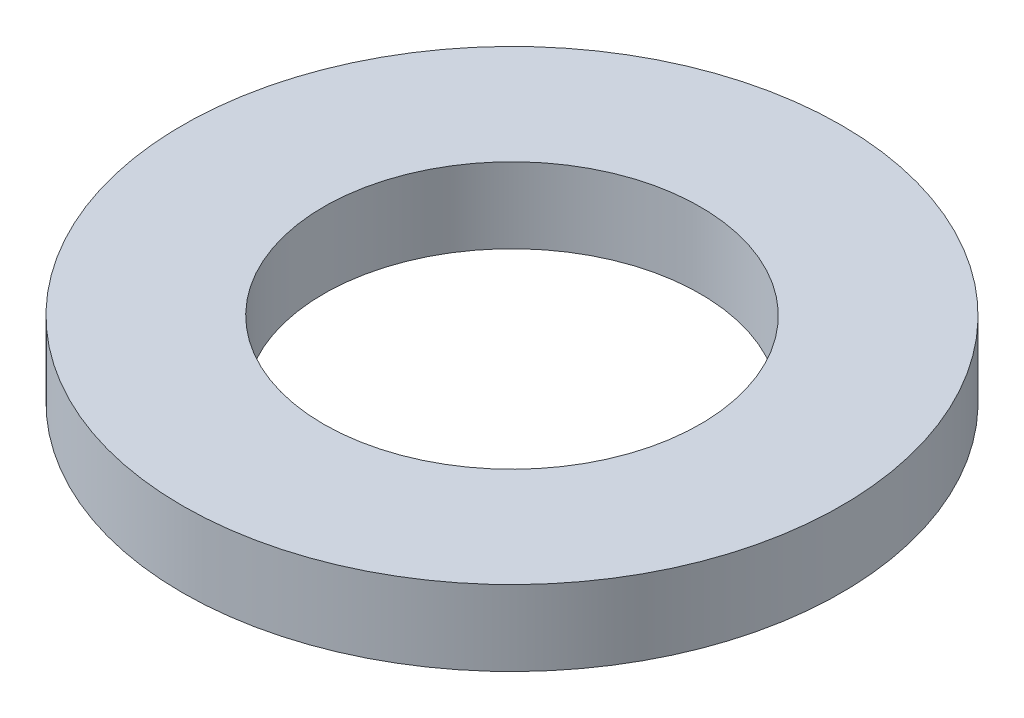
ISO-10303-21;
HEADER;
FILE_DESCRIPTION(('STEP AP214'),'2;1');
FILE_NAME('part.step','',(''),(''),'','','');
FILE_SCHEMA(('AUTOMOTIVE_DESIGN { 1 0 10303 214 1 1 1 1 }'));
ENDSEC;
DATA;
#1=APPLICATION_CONTEXT('core data for automotive mechanical design processes');
#2=APPLICATION_PROTOCOL_DEFINITION('international standard','automotive_design',2000,#1);
#3=PRODUCT_CONTEXT('',#1,'mechanical');
#4=PRODUCT('Part','Part','',(#3));
#5=PRODUCT_RELATED_PRODUCT_CATEGORY('part','',(#4));
#6=PRODUCT_DEFINITION_FORMATION('','',#4);
#7=PRODUCT_DEFINITION_CONTEXT('part definition',#1,'design');
#8=PRODUCT_DEFINITION('design','',#6,#7);
#9=PRODUCT_DEFINITION_SHAPE('','',#8);
#10=(LENGTH_UNIT() NAMED_UNIT(*) SI_UNIT(.MILLI.,.METRE.));
#11=(NAMED_UNIT(*) PLANE_ANGLE_UNIT() SI_UNIT($,.RADIAN.));
#12=(NAMED_UNIT(*) SI_UNIT($,.STERADIAN.) SOLID_ANGLE_UNIT());
#13=UNCERTAINTY_MEASURE_WITH_UNIT(LENGTH_MEASURE(1.E-05),#10,'distance_accuracy_value','');
#14=(GEOMETRIC_REPRESENTATION_CONTEXT(3) GLOBAL_UNCERTAINTY_ASSIGNED_CONTEXT((#13)) GLOBAL_UNIT_ASSIGNED_CONTEXT((#10,
#11,#12)) REPRESENTATION_CONTEXT('',''));
#15=CARTESIAN_POINT('',(0.,0.,0.));
#16=DIRECTION('',(0.,0.,1.));
#17=DIRECTION('',(1.,0.,0.));
#18=AXIS2_PLACEMENT_3D('',#15,#16,#17);
#19=CARTESIAN_POINT('',(0.,1.,0.));
#20=DIRECTION('',(0.,1.,0.));
#21=DIRECTION('',(0.,0.,1.));
#22=AXIS2_PLACEMENT_3D('',#19,#20,#21);
#23=PLANE('',#22);
#24=CARTESIAN_POINT('',(0.,1.,0.));
#25=DIRECTION('',(0.,1.,0.));
#26=DIRECTION('',(0.,0.,1.));
#27=AXIS2_PLACEMENT_3D('',#24,#25,#26);
#28=CIRCLE('',#27,4.375);
#29=CARTESIAN_POINT('',(0.,1.,4.375));
#30=VERTEX_POINT('',#29);
#31=EDGE_CURVE('E10',#30,#30,#28,.T.);
#32=ORIENTED_EDGE('',*,*,#31,.T.);
#33=EDGE_LOOP('',(#32));
#34=FACE_BOUND('',#33,.T.);
#35=CARTESIAN_POINT('',(0.,1.,0.));
#36=DIRECTION('',(0.,1.,0.));
#37=DIRECTION('',(0.,0.,1.));
#38=AXIS2_PLACEMENT_3D('',#35,#36,#37);
#39=CIRCLE('',#38,2.5);
#40=CARTESIAN_POINT('',(0.,1.,2.5));
#41=VERTEX_POINT('',#40);
#42=EDGE_CURVE('E50',#41,#41,#39,.T.);
#43=ORIENTED_EDGE('',*,*,#42,.F.);
#44=EDGE_LOOP('',(#43));
#45=FACE_BOUND('',#44,.T.);
#46=ADVANCED_FACE('F37',(#34,#45),#23,.T.);
#47=CARTESIAN_POINT('',(0.,0.,0.));
#48=DIRECTION('',(0.,1.,0.));
#49=DIRECTION('',(0.,0.,1.));
#50=AXIS2_PLACEMENT_3D('',#47,#48,#49);
#51=PLANE('',#50);
#52=CARTESIAN_POINT('',(0.,0.,0.));
#53=DIRECTION('',(0.,1.,0.));
#54=DIRECTION('',(0.,0.,1.));
#55=AXIS2_PLACEMENT_3D('',#52,#53,#54);
#56=CIRCLE('',#55,4.375);
#57=CARTESIAN_POINT('',(0.,0.,4.375));
#58=VERTEX_POINT('',#57);
#59=EDGE_CURVE('E41',#58,#58,#56,.T.);
#60=ORIENTED_EDGE('',*,*,#59,.F.);
#61=EDGE_LOOP('',(#60));
#62=FACE_BOUND('',#61,.T.);
#63=CARTESIAN_POINT('',(0.,0.,0.));
#64=DIRECTION('',(0.,1.,0.));
#65=DIRECTION('',(0.,0.,1.));
#66=AXIS2_PLACEMENT_3D('',#63,#64,#65);
#67=CIRCLE('',#66,2.5);
#68=CARTESIAN_POINT('',(0.,0.,2.5));
#69=VERTEX_POINT('',#68);
#70=EDGE_CURVE('E52',#69,#69,#67,.T.);
#71=ORIENTED_EDGE('',*,*,#70,.T.);
#72=EDGE_LOOP('',(#71));
#73=FACE_BOUND('',#72,.T.);
#74=ADVANCED_FACE('F64',(#62,#73),#51,.F.);
#75=CARTESIAN_POINT('',(0.,1.,0.));
#76=DIRECTION('',(0.,-1.,0.));
#77=DIRECTION('',(0.,0.,-1.));
#78=AXIS2_PLACEMENT_3D('',#75,#76,#77);
#79=CYLINDRICAL_SURFACE('',#78,4.375);
#80=ORIENTED_EDGE('',*,*,#31,.F.);
#81=EDGE_LOOP('',(#80));
#82=FACE_BOUND('',#81,.T.);
#83=ORIENTED_EDGE('',*,*,#59,.T.);
#84=EDGE_LOOP('',(#83));
#85=FACE_BOUND('',#84,.T.);
#86=ADVANCED_FACE('F39',(#82,#85),#79,.T.);
#87=CARTESIAN_POINT('',(0.,1.,0.));
#88=DIRECTION('',(0.,-1.,0.));
#89=DIRECTION('',(0.,0.,-1.));
#90=AXIS2_PLACEMENT_3D('',#87,#88,#89);
#91=CYLINDRICAL_SURFACE('',#90,2.5);
#92=ORIENTED_EDGE('',*,*,#42,.T.);
#93=EDGE_LOOP('',(#92));
#94=FACE_BOUND('',#93,.T.);
#95=ORIENTED_EDGE('',*,*,#70,.F.);
#96=EDGE_LOOP('',(#95));
#97=FACE_BOUND('',#96,.T.);
#98=ADVANCED_FACE('F60',(#94,#97),#91,.F.);
#99=CLOSED_SHELL('',(#46,#74,#86,#98));
#100=MANIFOLD_SOLID_BREP('B2',#99);
#101=ADVANCED_BREP_SHAPE_REPRESENTATION('',(#18,#100),#14);
#102=SHAPE_DEFINITION_REPRESENTATION(#9,#101);
ENDSEC;
END-ISO-10303-21;
